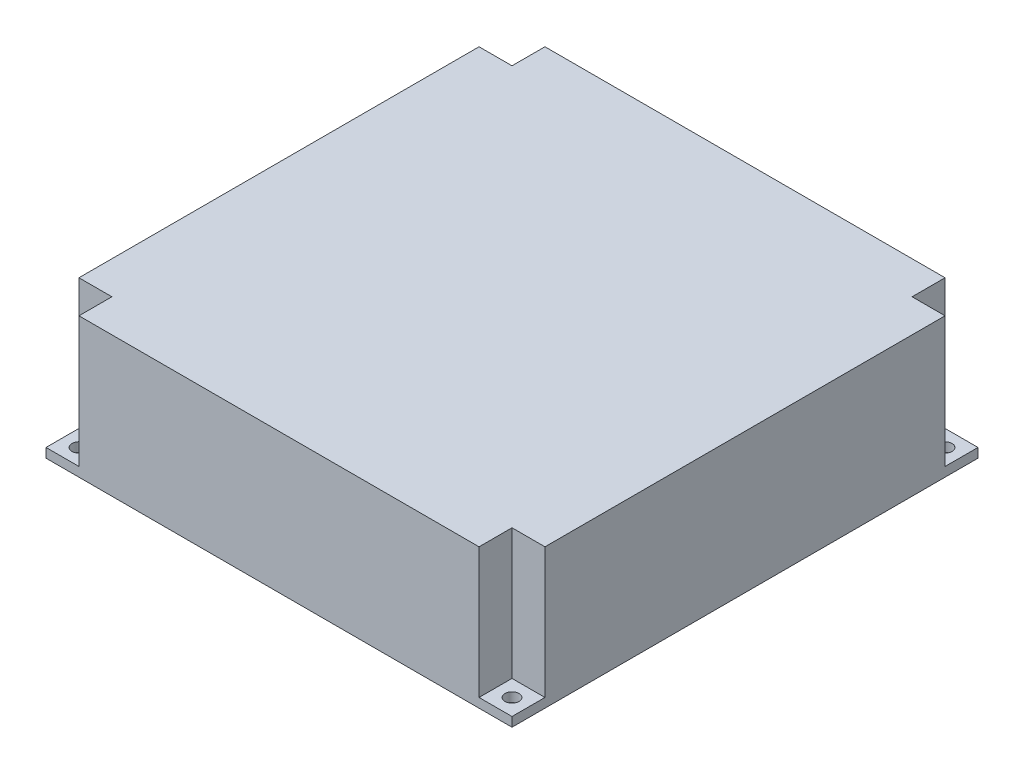
ISO-10303-21;
HEADER;
FILE_DESCRIPTION(('STEP AP214'),'2;1');
FILE_NAME('part.step','',(''),(''),'','','');
FILE_SCHEMA(('AUTOMOTIVE_DESIGN { 1 0 10303 214 1 1 1 1 }'));
ENDSEC;
DATA;
#1=APPLICATION_CONTEXT('core data for automotive mechanical design processes');
#2=APPLICATION_PROTOCOL_DEFINITION('international standard','automotive_design',2000,#1);
#3=PRODUCT_CONTEXT('',#1,'mechanical');
#4=PRODUCT('Part','Part','',(#3));
#5=PRODUCT_RELATED_PRODUCT_CATEGORY('part','',(#4));
#6=PRODUCT_DEFINITION_FORMATION('','',#4);
#7=PRODUCT_DEFINITION_CONTEXT('part definition',#1,'design');
#8=PRODUCT_DEFINITION('design','',#6,#7);
#9=PRODUCT_DEFINITION_SHAPE('','',#8);
#10=(LENGTH_UNIT() NAMED_UNIT(*) SI_UNIT(.MILLI.,.METRE.));
#11=(NAMED_UNIT(*) PLANE_ANGLE_UNIT() SI_UNIT($,.RADIAN.));
#12=(NAMED_UNIT(*) SI_UNIT($,.STERADIAN.) SOLID_ANGLE_UNIT());
#13=UNCERTAINTY_MEASURE_WITH_UNIT(LENGTH_MEASURE(1.E-05),#10,'distance_accuracy_value','');
#14=(GEOMETRIC_REPRESENTATION_CONTEXT(3) GLOBAL_UNCERTAINTY_ASSIGNED_CONTEXT((#13)) GLOBAL_UNIT_ASSIGNED_CONTEXT((#10,
#11,#12)) REPRESENTATION_CONTEXT('',''));
#15=CARTESIAN_POINT('',(0.,0.,0.));
#16=DIRECTION('',(0.,0.,1.));
#17=DIRECTION('',(1.,0.,0.));
#18=AXIS2_PLACEMENT_3D('',#15,#16,#17);
#19=CARTESIAN_POINT('',(-46.4644660940671,-8.,-46.4644660940674));
#20=DIRECTION('',(0.,1.,0.));
#21=DIRECTION('',(0.,0.,1.));
#22=AXIS2_PLACEMENT_3D('',#19,#20,#21);
#23=CYLINDRICAL_SURFACE('',#22,1.5);
#24=CARTESIAN_POINT('',(-46.4644660940671,0.,-46.4644660940674));
#25=DIRECTION('',(0.,1.,0.));
#26=DIRECTION('',(0.,0.,1.));
#27=AXIS2_PLACEMENT_3D('',#24,#25,#26);
#28=CIRCLE('',#27,1.5);
#29=CARTESIAN_POINT('',(-46.4644660940671,0.,-44.9644660940674));
#30=VERTEX_POINT('',#29);
#31=EDGE_CURVE('E387',#30,#30,#28,.T.);
#32=ORIENTED_EDGE('',*,*,#31,.F.);
#33=EDGE_LOOP('',(#32));
#34=FACE_BOUND('',#33,.T.);
#35=CARTESIAN_POINT('',(-46.4644660940671,2.,-46.4644660940674));
#36=DIRECTION('',(0.,1.,0.));
#37=DIRECTION('',(0.,0.,1.));
#38=AXIS2_PLACEMENT_3D('',#35,#36,#37);
#39=CIRCLE('',#38,1.5);
#40=CARTESIAN_POINT('',(-46.4644660940671,2.,-44.9644660940674));
#41=VERTEX_POINT('',#40);
#42=EDGE_CURVE('E399',#41,#41,#39,.F.);
#43=ORIENTED_EDGE('',*,*,#42,.F.);
#44=EDGE_LOOP('',(#43));
#45=FACE_BOUND('',#44,.T.);
#46=ADVANCED_FACE('F38',(#34,#45),#23,.F.);
#47=CARTESIAN_POINT('',(46.4644660940676,-8.,-46.464466094067));
#48=DIRECTION('',(0.,1.,0.));
#49=DIRECTION('',(0.,0.,1.));
#50=AXIS2_PLACEMENT_3D('',#47,#48,#49);
#51=CYLINDRICAL_SURFACE('',#50,1.50000000000001);
#52=CARTESIAN_POINT('',(46.4644660940676,0.,-46.464466094067));
#53=DIRECTION('',(0.,1.,0.));
#54=DIRECTION('',(0.,0.,1.));
#55=AXIS2_PLACEMENT_3D('',#52,#53,#54);
#56=CIRCLE('',#55,1.50000000000001);
#57=CARTESIAN_POINT('',(46.4644660940676,0.,-44.964466094067));
#58=VERTEX_POINT('',#57);
#59=EDGE_CURVE('E390',#58,#58,#56,.T.);
#60=ORIENTED_EDGE('',*,*,#59,.F.);
#61=EDGE_LOOP('',(#60));
#62=FACE_BOUND('',#61,.T.);
#63=CARTESIAN_POINT('',(46.4644660940676,2.,-46.464466094067));
#64=DIRECTION('',(0.,1.,0.));
#65=DIRECTION('',(0.,0.,1.));
#66=AXIS2_PLACEMENT_3D('',#63,#64,#65);
#67=CIRCLE('',#66,1.50000000000001);
#68=CARTESIAN_POINT('',(46.4644660940676,2.,-44.964466094067));
#69=VERTEX_POINT('',#68);
#70=EDGE_CURVE('E397',#69,#69,#67,.F.);
#71=ORIENTED_EDGE('',*,*,#70,.F.);
#72=EDGE_LOOP('',(#71));
#73=FACE_BOUND('',#72,.T.);
#74=ADVANCED_FACE('F427',(#62,#73),#51,.F.);
#75=CARTESIAN_POINT('',(46.4644660940668,-8.,46.4644660940678));
#76=DIRECTION('',(0.,1.,0.));
#77=DIRECTION('',(0.,0.,1.));
#78=AXIS2_PLACEMENT_3D('',#75,#76,#77);
#79=CYLINDRICAL_SURFACE('',#78,1.50000000000001);
#80=CARTESIAN_POINT('',(46.4644660940668,0.,46.4644660940678));
#81=DIRECTION('',(0.,1.,0.));
#82=DIRECTION('',(0.,0.,1.));
#83=AXIS2_PLACEMENT_3D('',#80,#81,#82);
#84=CIRCLE('',#83,1.50000000000001);
#85=CARTESIAN_POINT('',(46.4644660940668,0.,47.9644660940678));
#86=VERTEX_POINT('',#85);
#87=EDGE_CURVE('E372',#86,#86,#84,.T.);
#88=ORIENTED_EDGE('',*,*,#87,.F.);
#89=EDGE_LOOP('',(#88));
#90=FACE_BOUND('',#89,.T.);
#91=CARTESIAN_POINT('',(46.4644660940668,2.,46.4644660940678));
#92=DIRECTION('',(0.,1.,0.));
#93=DIRECTION('',(0.,0.,1.));
#94=AXIS2_PLACEMENT_3D('',#91,#92,#93);
#95=CIRCLE('',#94,1.50000000000001);
#96=CARTESIAN_POINT('',(46.4644660940668,2.,47.9644660940678));
#97=VERTEX_POINT('',#96);
#98=EDGE_CURVE('E350',#97,#97,#95,.F.);
#99=ORIENTED_EDGE('',*,*,#98,.F.);
#100=EDGE_LOOP('',(#99));
#101=FACE_BOUND('',#100,.T.);
#102=ADVANCED_FACE('F433',(#90,#101),#79,.F.);
#103=CARTESIAN_POINT('',(50.,30.,-50.));
#104=DIRECTION('',(-1.,0.,0.));
#105=DIRECTION('',(0.,0.,1.));
#106=AXIS2_PLACEMENT_3D('',#103,#104,#105);
#107=PLANE('',#106);
#108=DIRECTION('',(0.,0.,-1.));
#109=VECTOR('',#108,1.);
#110=CARTESIAN_POINT('',(50.,30.,-50.));
#111=LINE('',#110,#109);
#112=CARTESIAN_POINT('',(50.,30.,42.928932188135));
#113=VERTEX_POINT('',#112);
#114=CARTESIAN_POINT('',(50.0000000000003,30.,-42.9289321881342));
#115=VERTEX_POINT('',#114);
#116=EDGE_CURVE('E354',#113,#115,#111,.T.);
#117=ORIENTED_EDGE('',*,*,#116,.F.);
#118=DIRECTION('',(0.,1.,0.));
#119=VECTOR('',#118,1.);
#120=CARTESIAN_POINT('',(49.9999999999996,2.,42.928932188135));
#121=LINE('',#120,#119);
#122=CARTESIAN_POINT('',(49.9999999999996,2.,42.928932188135));
#123=VERTEX_POINT('',#122);
#124=EDGE_CURVE('E312',#123,#113,#121,.T.);
#125=ORIENTED_EDGE('',*,*,#124,.F.);
#126=DIRECTION('',(0.,0.,-1.));
#127=VECTOR('',#126,1.);
#128=CARTESIAN_POINT('',(49.9999999999996,2.,42.928932188135));
#129=LINE('',#128,#127);
#130=CARTESIAN_POINT('',(49.9999999999995,2.,50.0000000000005));
#131=VERTEX_POINT('',#130);
#132=EDGE_CURVE('E321',#131,#123,#129,.T.);
#133=ORIENTED_EDGE('',*,*,#132,.F.);
#134=DIRECTION('',(0.,-1.,0.));
#135=VECTOR('',#134,1.);
#136=CARTESIAN_POINT('',(50.,30.,50.));
#137=LINE('',#136,#135);
#138=CARTESIAN_POINT('',(50.,0.,50.));
#139=VERTEX_POINT('',#138);
#140=EDGE_CURVE('E367',#131,#139,#137,.T.);
#141=ORIENTED_EDGE('',*,*,#140,.T.);
#142=DIRECTION('',(0.,0.,-1.));
#143=VECTOR('',#142,1.);
#144=CARTESIAN_POINT('',(50.,0.,-50.));
#145=LINE('',#144,#143);
#146=CARTESIAN_POINT('',(50.,0.,-50.));
#147=VERTEX_POINT('',#146);
#148=EDGE_CURVE('E368',#139,#147,#145,.T.);
#149=ORIENTED_EDGE('',*,*,#148,.T.);
#150=DIRECTION('',(0.,-1.,0.));
#151=VECTOR('',#150,1.);
#152=CARTESIAN_POINT('',(50.,30.,-50.));
#153=LINE('',#152,#151);
#154=CARTESIAN_POINT('',(50.0000000000003,2.,-49.9999999999997));
#155=VERTEX_POINT('',#154);
#156=EDGE_CURVE('E11',#155,#147,#153,.T.);
#157=ORIENTED_EDGE('',*,*,#156,.F.);
#158=DIRECTION('',(0.,0.,-1.));
#159=VECTOR('',#158,1.);
#160=CARTESIAN_POINT('',(50.0000000000003,2.,-42.9289321881342));
#161=LINE('',#160,#159);
#162=CARTESIAN_POINT('',(50.0000000000003,2.,-42.9289321881342));
#163=VERTEX_POINT('',#162);
#164=EDGE_CURVE('E291',#163,#155,#161,.T.);
#165=ORIENTED_EDGE('',*,*,#164,.F.);
#166=DIRECTION('',(0.,1.,0.));
#167=VECTOR('',#166,1.);
#168=CARTESIAN_POINT('',(50.0000000000003,2.,-42.9289321881342));
#169=LINE('',#168,#167);
#170=EDGE_CURVE('E294',#163,#115,#169,.T.);
#171=ORIENTED_EDGE('',*,*,#170,.T.);
#172=EDGE_LOOP('',(#117,#125,#133,#141,#149,#157,#165,#171));
#173=FACE_BOUND('',#172,.T.);
#174=ADVANCED_FACE('F40',(#173),#107,.F.);
#175=CARTESIAN_POINT('',(-50.,30.,-50.));
#176=DIRECTION('',(0.,0.,1.));
#177=DIRECTION('',(1.,0.,0.));
#178=AXIS2_PLACEMENT_3D('',#175,#176,#177);
#179=PLANE('',#178);
#180=DIRECTION('',(-1.,0.,0.));
#181=VECTOR('',#180,1.);
#182=CARTESIAN_POINT('',(-50.,30.,-50.));
#183=LINE('',#182,#181);
#184=CARTESIAN_POINT('',(42.9289321881348,30.,-50.));
#185=VERTEX_POINT('',#184);
#186=CARTESIAN_POINT('',(-42.9289321881344,30.,-50.0000000000002));
#187=VERTEX_POINT('',#186);
#188=EDGE_CURVE('E357',#185,#187,#183,.T.);
#189=ORIENTED_EDGE('',*,*,#188,.F.);
#190=DIRECTION('',(0.,1.,0.));
#191=VECTOR('',#190,1.);
#192=CARTESIAN_POINT('',(42.9289321881349,2.,-49.9999999999997));
#193=LINE('',#192,#191);
#194=CARTESIAN_POINT('',(42.9289321881349,2.,-49.9999999999997));
#195=VERTEX_POINT('',#194);
#196=EDGE_CURVE('E289',#195,#185,#193,.T.);
#197=ORIENTED_EDGE('',*,*,#196,.F.);
#198=DIRECTION('',(-1.,0.,0.));
#199=VECTOR('',#198,1.);
#200=CARTESIAN_POINT('',(42.9289321881349,2.,-49.9999999999997));
#201=LINE('',#200,#199);
#202=EDGE_CURVE('E300',#155,#195,#201,.T.);
#203=ORIENTED_EDGE('',*,*,#202,.F.);
#204=ORIENTED_EDGE('',*,*,#156,.T.);
#205=DIRECTION('',(-1.,0.,0.));
#206=VECTOR('',#205,1.);
#207=CARTESIAN_POINT('',(-50.,0.,-50.));
#208=LINE('',#207,#206);
#209=CARTESIAN_POINT('',(-50.,0.,-50.));
#210=VERTEX_POINT('',#209);
#211=EDGE_CURVE('E371',#147,#210,#208,.T.);
#212=ORIENTED_EDGE('',*,*,#211,.T.);
#213=DIRECTION('',(0.,-1.,0.));
#214=VECTOR('',#213,1.);
#215=CARTESIAN_POINT('',(-50.,30.,-50.));
#216=LINE('',#215,#214);
#217=CARTESIAN_POINT('',(-49.9999999999998,2.,-50.0000000000002));
#218=VERTEX_POINT('',#217);
#219=EDGE_CURVE('E47',#218,#210,#216,.T.);
#220=ORIENTED_EDGE('',*,*,#219,.F.);
#221=DIRECTION('',(-1.,0.,0.));
#222=VECTOR('',#221,1.);
#223=CARTESIAN_POINT('',(-42.9289321881344,2.,-50.0000000000002));
#224=LINE('',#223,#222);
#225=CARTESIAN_POINT('',(-42.9289321881344,2.,-50.0000000000002));
#226=VERTEX_POINT('',#225);
#227=EDGE_CURVE('E266',#226,#218,#224,.T.);
#228=ORIENTED_EDGE('',*,*,#227,.F.);
#229=DIRECTION('',(0.,1.,0.));
#230=VECTOR('',#229,1.);
#231=CARTESIAN_POINT('',(-42.9289321881344,2.,-50.0000000000002));
#232=LINE('',#231,#230);
#233=EDGE_CURVE('E269',#226,#187,#232,.T.);
#234=ORIENTED_EDGE('',*,*,#233,.T.);
#235=EDGE_LOOP('',(#189,#197,#203,#204,#212,#220,#228,#234));
#236=FACE_BOUND('',#235,.T.);
#237=ADVANCED_FACE('F458',(#236),#179,.F.);
#238=CARTESIAN_POINT('',(-50.,30.,-50.));
#239=DIRECTION('',(1.,0.,0.));
#240=DIRECTION('',(0.,0.,-1.));
#241=AXIS2_PLACEMENT_3D('',#238,#239,#240);
#242=PLANE('',#241);
#243=DIRECTION('',(0.,0.,1.));
#244=VECTOR('',#243,1.);
#245=CARTESIAN_POINT('',(-50.,30.,-50.));
#246=LINE('',#245,#244);
#247=CARTESIAN_POINT('',(-50.,30.,-42.9289321881347));
#248=VERTEX_POINT('',#247);
#249=CARTESIAN_POINT('',(-50.,30.,42.9289321881345));
#250=VERTEX_POINT('',#249);
#251=EDGE_CURVE('E361',#248,#250,#246,.T.);
#252=ORIENTED_EDGE('',*,*,#251,.F.);
#253=DIRECTION('',(0.,1.,0.));
#254=VECTOR('',#253,1.);
#255=CARTESIAN_POINT('',(-49.9999999999999,2.,-42.9289321881347));
#256=LINE('',#255,#254);
#257=CARTESIAN_POINT('',(-49.9999999999999,2.,-42.9289321881347));
#258=VERTEX_POINT('',#257);
#259=EDGE_CURVE('E264',#258,#248,#256,.T.);
#260=ORIENTED_EDGE('',*,*,#259,.F.);
#261=DIRECTION('',(0.,0.,1.));
#262=VECTOR('',#261,1.);
#263=CARTESIAN_POINT('',(-49.9999999999999,2.,-42.9289321881347));
#264=LINE('',#263,#262);
#265=EDGE_CURVE('E276',#218,#258,#264,.T.);
#266=ORIENTED_EDGE('',*,*,#265,.F.);
#267=ORIENTED_EDGE('',*,*,#219,.T.);
#268=DIRECTION('',(0.,0.,1.));
#269=VECTOR('',#268,1.);
#270=CARTESIAN_POINT('',(-50.,0.,-50.));
#271=LINE('',#270,#269);
#272=CARTESIAN_POINT('',(-50.,0.,50.));
#273=VERTEX_POINT('',#272);
#274=EDGE_CURVE('E375',#210,#273,#271,.T.);
#275=ORIENTED_EDGE('',*,*,#274,.T.);
#276=DIRECTION('',(0.,-1.,0.));
#277=VECTOR('',#276,1.);
#278=CARTESIAN_POINT('',(-50.,30.,50.));
#279=LINE('',#278,#277);
#280=CARTESIAN_POINT('',(-50.,2.,50.));
#281=VERTEX_POINT('',#280);
#282=EDGE_CURVE('E381',#281,#273,#279,.T.);
#283=ORIENTED_EDGE('',*,*,#282,.F.);
#284=DIRECTION('',(0.,0.,1.));
#285=VECTOR('',#284,1.);
#286=CARTESIAN_POINT('',(-50.,2.,42.9289321881345));
#287=LINE('',#286,#285);
#288=CARTESIAN_POINT('',(-50.,2.,42.9289321881345));
#289=VERTEX_POINT('',#288);
#290=EDGE_CURVE('E333',#289,#281,#287,.T.);
#291=ORIENTED_EDGE('',*,*,#290,.F.);
#292=DIRECTION('',(0.,1.,0.));
#293=VECTOR('',#292,1.);
#294=CARTESIAN_POINT('',(-50.,2.,42.9289321881345));
#295=LINE('',#294,#293);
#296=EDGE_CURVE('E347',#289,#250,#295,.T.);
#297=ORIENTED_EDGE('',*,*,#296,.T.);
#298=EDGE_LOOP('',(#252,#260,#266,#267,#275,#283,#291,#297));
#299=FACE_BOUND('',#298,.T.);
#300=ADVANCED_FACE('F455',(#299),#242,.F.);
#301=CARTESIAN_POINT('',(-50.,30.,50.));
#302=DIRECTION('',(0.,0.,-1.));
#303=DIRECTION('',(-1.,0.,0.));
#304=AXIS2_PLACEMENT_3D('',#301,#302,#303);
#305=PLANE('',#304);
#306=DIRECTION('',(1.,0.,0.));
#307=VECTOR('',#306,1.);
#308=CARTESIAN_POINT('',(42.928932188134,2.,50.0000000000005));
#309=LINE('',#308,#307);
#310=CARTESIAN_POINT('',(42.928932188134,2.,50.0000000000005));
#311=VERTEX_POINT('',#310);
#312=EDGE_CURVE('E314',#311,#131,#309,.T.);
#313=ORIENTED_EDGE('',*,*,#312,.F.);
#314=DIRECTION('',(0.,1.,0.));
#315=VECTOR('',#314,1.);
#316=CARTESIAN_POINT('',(42.928932188134,2.,50.0000000000005));
#317=LINE('',#316,#315);
#318=CARTESIAN_POINT('',(42.928932188134,30.,50.0000000000005));
#319=VERTEX_POINT('',#318);
#320=EDGE_CURVE('E263',#311,#319,#317,.T.);
#321=ORIENTED_EDGE('',*,*,#320,.T.);
#322=DIRECTION('',(1.,0.,0.));
#323=VECTOR('',#322,1.);
#324=CARTESIAN_POINT('',(-50.,30.,50.));
#325=LINE('',#324,#323);
#326=CARTESIAN_POINT('',(-42.9289321881345,30.,50.));
#327=VERTEX_POINT('',#326);
#328=EDGE_CURVE('E364',#327,#319,#325,.T.);
#329=ORIENTED_EDGE('',*,*,#328,.F.);
#330=DIRECTION('',(0.,1.,0.));
#331=VECTOR('',#330,1.);
#332=CARTESIAN_POINT('',(-42.9289321881345,2.,50.));
#333=LINE('',#332,#331);
#334=CARTESIAN_POINT('',(-42.9289321881345,2.,50.));
#335=VERTEX_POINT('',#334);
#336=EDGE_CURVE('E63',#335,#327,#333,.T.);
#337=ORIENTED_EDGE('',*,*,#336,.F.);
#338=DIRECTION('',(1.,0.,0.));
#339=VECTOR('',#338,1.);
#340=CARTESIAN_POINT('',(-42.9289321881345,2.,50.));
#341=LINE('',#340,#339);
#342=EDGE_CURVE('E335',#281,#335,#341,.T.);
#343=ORIENTED_EDGE('',*,*,#342,.F.);
#344=ORIENTED_EDGE('',*,*,#282,.T.);
#345=DIRECTION('',(1.,0.,0.));
#346=VECTOR('',#345,1.);
#347=CARTESIAN_POINT('',(-50.,0.,50.));
#348=LINE('',#347,#346);
#349=EDGE_CURVE('E358',#273,#139,#348,.T.);
#350=ORIENTED_EDGE('',*,*,#349,.T.);
#351=ORIENTED_EDGE('',*,*,#140,.F.);
#352=EDGE_LOOP('',(#313,#321,#329,#337,#343,#344,#350,#351));
#353=FACE_BOUND('',#352,.T.);
#354=ADVANCED_FACE('F449',(#353),#305,.F.);
#355=CARTESIAN_POINT('',(0.,30.,0.));
#356=DIRECTION('',(0.,1.,0.));
#357=DIRECTION('',(0.,0.,1.));
#358=AXIS2_PLACEMENT_3D('',#355,#356,#357);
#359=PLANE('',#358);
#360=DIRECTION('',(0.,0.,1.));
#361=VECTOR('',#360,1.);
#362=CARTESIAN_POINT('',(42.9289321881341,30.,42.928932188135));
#363=LINE('',#362,#361);
#364=CARTESIAN_POINT('',(42.9289321881341,30.,42.928932188135));
#365=VERTEX_POINT('',#364);
#366=EDGE_CURVE('E319',#365,#319,#363,.T.);
#367=ORIENTED_EDGE('',*,*,#366,.F.);
#368=DIRECTION('',(-1.,0.,0.));
#369=VECTOR('',#368,1.);
#370=CARTESIAN_POINT('',(42.9289321881341,30.,42.928932188135));
#371=LINE('',#370,#369);
#372=EDGE_CURVE('E297',#113,#365,#371,.T.);
#373=ORIENTED_EDGE('',*,*,#372,.F.);
#374=ORIENTED_EDGE('',*,*,#116,.T.);
#375=DIRECTION('',(1.,0.,0.));
#376=VECTOR('',#375,1.);
#377=CARTESIAN_POINT('',(42.9289321881348,30.,-42.9289321881343));
#378=LINE('',#377,#376);
#379=CARTESIAN_POINT('',(42.9289321881348,30.,-42.9289321881343));
#380=VERTEX_POINT('',#379);
#381=EDGE_CURVE('E298',#380,#115,#378,.T.);
#382=ORIENTED_EDGE('',*,*,#381,.F.);
#383=DIRECTION('',(0.,0.,1.));
#384=VECTOR('',#383,1.);
#385=CARTESIAN_POINT('',(42.9289321881348,30.,-42.9289321881343));
#386=LINE('',#385,#384);
#387=EDGE_CURVE('E272',#185,#380,#386,.T.);
#388=ORIENTED_EDGE('',*,*,#387,.F.);
#389=ORIENTED_EDGE('',*,*,#188,.T.);
#390=DIRECTION('',(0.,0.,-1.));
#391=VECTOR('',#390,1.);
#392=CARTESIAN_POINT('',(-42.9289321881344,30.,-42.9289321881347));
#393=LINE('',#392,#391);
#394=CARTESIAN_POINT('',(-42.9289321881344,30.,-42.9289321881347));
#395=VERTEX_POINT('',#394);
#396=EDGE_CURVE('E273',#395,#187,#393,.T.);
#397=ORIENTED_EDGE('',*,*,#396,.F.);
#398=DIRECTION('',(1.,0.,0.));
#399=VECTOR('',#398,1.);
#400=CARTESIAN_POINT('',(-42.9289321881344,30.,-42.9289321881347));
#401=LINE('',#400,#399);
#402=EDGE_CURVE('E275',#248,#395,#401,.T.);
#403=ORIENTED_EDGE('',*,*,#402,.F.);
#404=ORIENTED_EDGE('',*,*,#251,.T.);
#405=DIRECTION('',(-1.,0.,0.));
#406=VECTOR('',#405,1.);
#407=CARTESIAN_POINT('',(-42.9289321881345,30.,42.9289321881345));
#408=LINE('',#407,#406);
#409=CARTESIAN_POINT('',(-42.9289321881345,30.,42.9289321881345));
#410=VERTEX_POINT('',#409);
#411=EDGE_CURVE('E336',#410,#250,#408,.T.);
#412=ORIENTED_EDGE('',*,*,#411,.F.);
#413=DIRECTION('',(0.,0.,-1.));
#414=VECTOR('',#413,1.);
#415=CARTESIAN_POINT('',(-42.9289321881345,30.,42.9289321881345));
#416=LINE('',#415,#414);
#417=EDGE_CURVE('E279',#327,#410,#416,.T.);
#418=ORIENTED_EDGE('',*,*,#417,.F.);
#419=ORIENTED_EDGE('',*,*,#328,.T.);
#420=EDGE_LOOP('',(#367,#373,#374,#382,#388,#389,#397,#403,#404,#412,#418,#419));
#421=FACE_BOUND('',#420,.T.);
#422=ADVANCED_FACE('F446',(#421),#359,.T.);
#423=CARTESIAN_POINT('',(0.,0.,0.));
#424=DIRECTION('',(0.,1.,0.));
#425=DIRECTION('',(0.,0.,1.));
#426=AXIS2_PLACEMENT_3D('',#423,#424,#425);
#427=PLANE('',#426);
#428=DIRECTION('',(0.,0.,1.));
#429=VECTOR('',#428,1.);
#430=CARTESIAN_POINT('',(40.9289321881345,0.,2.81147158996242E-13));
#431=LINE('',#430,#429);
#432=CARTESIAN_POINT('',(40.9289321881348,0.,-48.));
#433=VERTEX_POINT('',#432);
#434=CARTESIAN_POINT('',(40.9289321881348,0.,-40.9289321881343));
#435=VERTEX_POINT('',#434);
#436=EDGE_CURVE('E255',#433,#435,#431,.T.);
#437=ORIENTED_EDGE('',*,*,#436,.F.);
#438=DIRECTION('',(-1.,0.,0.));
#439=VECTOR('',#438,1.);
#440=CARTESIAN_POINT('',(-50.,0.,-48.));
#441=LINE('',#440,#439);
#442=CARTESIAN_POINT('',(-40.9289321881344,0.,-48.));
#443=VERTEX_POINT('',#442);
#444=EDGE_CURVE('E237',#433,#443,#441,.T.);
#445=ORIENTED_EDGE('',*,*,#444,.T.);
#446=DIRECTION('',(0.,0.,-1.));
#447=VECTOR('',#446,1.);
#448=CARTESIAN_POINT('',(-40.9289321881345,0.,-1.20491639569818E-13));
#449=LINE('',#448,#447);
#450=CARTESIAN_POINT('',(-40.9289321881344,0.,-40.9289321881347));
#451=VERTEX_POINT('',#450);
#452=EDGE_CURVE('E246',#451,#443,#449,.T.);
#453=ORIENTED_EDGE('',*,*,#452,.F.);
#454=DIRECTION('',(1.,0.,0.));
#455=VECTOR('',#454,1.);
#456=CARTESIAN_POINT('',(1.20491639569818E-13,0.,-40.9289321881346));
#457=LINE('',#456,#455);
#458=CARTESIAN_POINT('',(-48.,0.,-40.9289321881347));
#459=VERTEX_POINT('',#458);
#460=EDGE_CURVE('E241',#459,#451,#457,.T.);
#461=ORIENTED_EDGE('',*,*,#460,.F.);
#462=DIRECTION('',(0.,0.,1.));
#463=VECTOR('',#462,1.);
#464=CARTESIAN_POINT('',(-48.,0.,-50.));
#465=LINE('',#464,#463);
#466=CARTESIAN_POINT('',(-48.,0.,40.9289321881345));
#467=VERTEX_POINT('',#466);
#468=EDGE_CURVE('E225',#459,#467,#465,.T.);
#469=ORIENTED_EDGE('',*,*,#468,.T.);
#470=DIRECTION('',(-1.,0.,0.));
#471=VECTOR('',#470,1.);
#472=CARTESIAN_POINT('',(-42.9289321881345,0.,40.9289321881345));
#473=LINE('',#472,#471);
#474=CARTESIAN_POINT('',(-40.9289321881345,0.,40.9289321881345));
#475=VERTEX_POINT('',#474);
#476=EDGE_CURVE('E873',#475,#467,#473,.T.);
#477=ORIENTED_EDGE('',*,*,#476,.F.);
#478=DIRECTION('',(0.,0.,-1.));
#479=VECTOR('',#478,1.);
#480=CARTESIAN_POINT('',(-40.9289321881345,0.,42.9289321881345));
#481=LINE('',#480,#479);
#482=CARTESIAN_POINT('',(-40.9289321881345,0.,48.));
#483=VERTEX_POINT('',#482);
#484=EDGE_CURVE('E876',#483,#475,#481,.T.);
#485=ORIENTED_EDGE('',*,*,#484,.F.);
#486=DIRECTION('',(1.,0.,0.));
#487=VECTOR('',#486,1.);
#488=CARTESIAN_POINT('',(-50.,0.,48.));
#489=LINE('',#488,#487);
#490=CARTESIAN_POINT('',(40.928932188134,0.,48.));
#491=VERTEX_POINT('',#490);
#492=EDGE_CURVE('E236',#483,#491,#489,.T.);
#493=ORIENTED_EDGE('',*,*,#492,.T.);
#494=DIRECTION('',(0.,0.,1.));
#495=VECTOR('',#494,1.);
#496=CARTESIAN_POINT('',(40.9289321881345,0.,4.0163879856606E-13));
#497=LINE('',#496,#495);
#498=CARTESIAN_POINT('',(40.9289321881341,0.,40.928932188135));
#499=VERTEX_POINT('',#498);
#500=EDGE_CURVE('E900',#499,#491,#497,.T.);
#501=ORIENTED_EDGE('',*,*,#500,.F.);
#502=DIRECTION('',(-1.,0.,0.));
#503=VECTOR('',#502,1.);
#504=CARTESIAN_POINT('',(-4.0163879856606E-13,0.,40.9289321881346));
#505=LINE('',#504,#503);
#506=CARTESIAN_POINT('',(48.,0.,40.928932188135));
#507=VERTEX_POINT('',#506);
#508=EDGE_CURVE('E886',#507,#499,#505,.T.);
#509=ORIENTED_EDGE('',*,*,#508,.F.);
#510=DIRECTION('',(0.,0.,-1.));
#511=VECTOR('',#510,1.);
#512=CARTESIAN_POINT('',(48.,0.,-50.));
#513=LINE('',#512,#511);
#514=CARTESIAN_POINT('',(48.,0.,-40.9289321881342));
#515=VERTEX_POINT('',#514);
#516=EDGE_CURVE('E883',#507,#515,#513,.T.);
#517=ORIENTED_EDGE('',*,*,#516,.T.);
#518=DIRECTION('',(1.,0.,0.));
#519=VECTOR('',#518,1.);
#520=CARTESIAN_POINT('',(2.81147158996242E-13,0.,-40.9289321881345));
#521=LINE('',#520,#519);
#522=EDGE_CURVE('E252',#435,#515,#521,.T.);
#523=ORIENTED_EDGE('',*,*,#522,.F.);
#524=EDGE_LOOP('',(#437,#445,#453,#461,#469,#477,#485,#493,#501,#509,#517,#523));
#525=FACE_BOUND('',#524,.T.);
#526=ORIENTED_EDGE('',*,*,#87,.T.);
#527=EDGE_LOOP('',(#526));
#528=FACE_BOUND('',#527,.T.);
#529=ORIENTED_EDGE('',*,*,#59,.T.);
#530=EDGE_LOOP('',(#529));
#531=FACE_BOUND('',#530,.T.);
#532=ORIENTED_EDGE('',*,*,#31,.T.);
#533=EDGE_LOOP('',(#532));
#534=FACE_BOUND('',#533,.T.);
#535=CARTESIAN_POINT('',(-46.4644660940673,0.,46.4644660940673));
#536=DIRECTION('',(0.,1.,0.));
#537=DIRECTION('',(0.,0.,1.));
#538=AXIS2_PLACEMENT_3D('',#535,#536,#537);
#539=CIRCLE('',#538,1.5);
#540=CARTESIAN_POINT('',(-46.4644660940673,0.,47.9644660940673));
#541=VERTEX_POINT('',#540);
#542=EDGE_CURVE('E384',#541,#541,#539,.T.);
#543=ORIENTED_EDGE('',*,*,#542,.T.);
#544=EDGE_LOOP('',(#543));
#545=FACE_BOUND('',#544,.T.);
#546=ORIENTED_EDGE('',*,*,#148,.F.);
#547=ORIENTED_EDGE('',*,*,#349,.F.);
#548=ORIENTED_EDGE('',*,*,#274,.F.);
#549=ORIENTED_EDGE('',*,*,#211,.F.);
#550=EDGE_LOOP('',(#546,#547,#548,#549));
#551=FACE_BOUND('',#550,.T.);
#552=ADVANCED_FACE('F249',(#525,#528,#531,#534,#545,#551),#427,.F.);
#553=CARTESIAN_POINT('',(-46.4644660940673,-8.,46.4644660940673));
#554=DIRECTION('',(0.,1.,0.));
#555=DIRECTION('',(0.,0.,1.));
#556=AXIS2_PLACEMENT_3D('',#553,#554,#555);
#557=CYLINDRICAL_SURFACE('',#556,1.5);
#558=CARTESIAN_POINT('',(-46.4644660940673,2.,46.4644660940673));
#559=DIRECTION('',(0.,-1.,0.));
#560=DIRECTION('',(0.,0.,-1.));
#561=AXIS2_PLACEMENT_3D('',#558,#559,#560);
#562=CIRCLE('',#561,1.5);
#563=CARTESIAN_POINT('',(-46.4644660940673,2.,44.9644660940673));
#564=VERTEX_POINT('',#563);
#565=EDGE_CURVE('E42',#564,#564,#562,.F.);
#566=ORIENTED_EDGE('',*,*,#565,.T.);
#567=EDGE_LOOP('',(#566));
#568=FACE_BOUND('',#567,.T.);
#569=ORIENTED_EDGE('',*,*,#542,.F.);
#570=EDGE_LOOP('',(#569));
#571=FACE_BOUND('',#570,.T.);
#572=ADVANCED_FACE('F406',(#568,#571),#557,.F.);
#573=CARTESIAN_POINT('',(0.,2.,0.));
#574=DIRECTION('',(0.,1.,0.));
#575=DIRECTION('',(0.,0.,1.));
#576=AXIS2_PLACEMENT_3D('',#573,#574,#575);
#577=PLANE('',#576);
#578=ORIENTED_EDGE('',*,*,#132,.T.);
#579=DIRECTION('',(-1.,0.,0.));
#580=VECTOR('',#579,1.);
#581=CARTESIAN_POINT('',(42.9289321881341,2.,42.928932188135));
#582=LINE('',#581,#580);
#583=CARTESIAN_POINT('',(42.9289321881341,2.,42.928932188135));
#584=VERTEX_POINT('',#583);
#585=EDGE_CURVE('E328',#123,#584,#582,.T.);
#586=ORIENTED_EDGE('',*,*,#585,.T.);
#587=DIRECTION('',(0.,0.,1.));
#588=VECTOR('',#587,1.);
#589=CARTESIAN_POINT('',(42.9289321881341,2.,42.928932188135));
#590=LINE('',#589,#588);
#591=EDGE_CURVE('E325',#584,#311,#590,.T.);
#592=ORIENTED_EDGE('',*,*,#591,.T.);
#593=ORIENTED_EDGE('',*,*,#312,.T.);
#594=EDGE_LOOP('',(#578,#586,#592,#593));
#595=FACE_BOUND('',#594,.T.);
#596=ORIENTED_EDGE('',*,*,#98,.T.);
#597=EDGE_LOOP('',(#596));
#598=FACE_BOUND('',#597,.T.);
#599=ADVANCED_FACE('F445',(#595,#598),#577,.T.);
#600=CARTESIAN_POINT('',(42.9289321881341,2.,42.928932188135));
#601=DIRECTION('',(-1.,0.,0.));
#602=DIRECTION('',(0.,0.,1.));
#603=AXIS2_PLACEMENT_3D('',#600,#601,#602);
#604=PLANE('',#603);
#605=ORIENTED_EDGE('',*,*,#366,.T.);
#606=ORIENTED_EDGE('',*,*,#320,.F.);
#607=ORIENTED_EDGE('',*,*,#591,.F.);
#608=DIRECTION('',(0.,1.,0.));
#609=VECTOR('',#608,1.);
#610=CARTESIAN_POINT('',(42.9289321881341,2.,42.928932188135));
#611=LINE('',#610,#609);
#612=EDGE_CURVE('E315',#584,#365,#611,.T.);
#613=ORIENTED_EDGE('',*,*,#612,.T.);
#614=EDGE_LOOP('',(#605,#606,#607,#613));
#615=FACE_BOUND('',#614,.T.);
#616=ADVANCED_FACE('F508',(#615),#604,.F.);
#617=CARTESIAN_POINT('',(42.9289321881341,2.,42.928932188135));
#618=DIRECTION('',(0.,0.,-1.));
#619=DIRECTION('',(-1.,0.,0.));
#620=AXIS2_PLACEMENT_3D('',#617,#618,#619);
#621=PLANE('',#620);
#622=ORIENTED_EDGE('',*,*,#372,.T.);
#623=ORIENTED_EDGE('',*,*,#612,.F.);
#624=ORIENTED_EDGE('',*,*,#585,.F.);
#625=ORIENTED_EDGE('',*,*,#124,.T.);
#626=EDGE_LOOP('',(#622,#623,#624,#625));
#627=FACE_BOUND('',#626,.T.);
#628=ADVANCED_FACE('F513',(#627),#621,.F.);
#629=CARTESIAN_POINT('',(0.,2.,0.));
#630=DIRECTION('',(0.,1.,0.));
#631=DIRECTION('',(0.,0.,1.));
#632=AXIS2_PLACEMENT_3D('',#629,#630,#631);
#633=PLANE('',#632);
#634=ORIENTED_EDGE('',*,*,#202,.T.);
#635=DIRECTION('',(0.,0.,1.));
#636=VECTOR('',#635,1.);
#637=CARTESIAN_POINT('',(42.9289321881348,2.,-42.9289321881343));
#638=LINE('',#637,#636);
#639=CARTESIAN_POINT('',(42.9289321881348,2.,-42.9289321881343));
#640=VERTEX_POINT('',#639);
#641=EDGE_CURVE('E307',#195,#640,#638,.T.);
#642=ORIENTED_EDGE('',*,*,#641,.T.);
#643=DIRECTION('',(1.,0.,0.));
#644=VECTOR('',#643,1.);
#645=CARTESIAN_POINT('',(42.9289321881348,2.,-42.9289321881343));
#646=LINE('',#645,#644);
#647=EDGE_CURVE('E304',#640,#163,#646,.T.);
#648=ORIENTED_EDGE('',*,*,#647,.T.);
#649=ORIENTED_EDGE('',*,*,#164,.T.);
#650=EDGE_LOOP('',(#634,#642,#648,#649));
#651=FACE_BOUND('',#650,.T.);
#652=ORIENTED_EDGE('',*,*,#70,.T.);
#653=EDGE_LOOP('',(#652));
#654=FACE_BOUND('',#653,.T.);
#655=ADVANCED_FACE('F479',(#651,#654),#633,.T.);
#656=CARTESIAN_POINT('',(42.9289321881348,2.,-42.9289321881343));
#657=DIRECTION('',(0.,0.,1.));
#658=DIRECTION('',(1.,0.,0.));
#659=AXIS2_PLACEMENT_3D('',#656,#657,#658);
#660=PLANE('',#659);
#661=ORIENTED_EDGE('',*,*,#381,.T.);
#662=ORIENTED_EDGE('',*,*,#170,.F.);
#663=ORIENTED_EDGE('',*,*,#647,.F.);
#664=DIRECTION('',(0.,1.,0.));
#665=VECTOR('',#664,1.);
#666=CARTESIAN_POINT('',(42.9289321881348,2.,-42.9289321881343));
#667=LINE('',#666,#665);
#668=EDGE_CURVE('E292',#640,#380,#667,.T.);
#669=ORIENTED_EDGE('',*,*,#668,.T.);
#670=EDGE_LOOP('',(#661,#662,#663,#669));
#671=FACE_BOUND('',#670,.T.);
#672=ADVANCED_FACE('F516',(#671),#660,.F.);
#673=CARTESIAN_POINT('',(42.9289321881348,2.,-42.9289321881343));
#674=DIRECTION('',(-1.,0.,0.));
#675=DIRECTION('',(0.,0.,1.));
#676=AXIS2_PLACEMENT_3D('',#673,#674,#675);
#677=PLANE('',#676);
#678=ORIENTED_EDGE('',*,*,#387,.T.);
#679=ORIENTED_EDGE('',*,*,#668,.F.);
#680=ORIENTED_EDGE('',*,*,#641,.F.);
#681=ORIENTED_EDGE('',*,*,#196,.T.);
#682=EDGE_LOOP('',(#678,#679,#680,#681));
#683=FACE_BOUND('',#682,.T.);
#684=ADVANCED_FACE('F476',(#683),#677,.F.);
#685=CARTESIAN_POINT('',(0.,2.,0.));
#686=DIRECTION('',(0.,1.,0.));
#687=DIRECTION('',(0.,0.,1.));
#688=AXIS2_PLACEMENT_3D('',#685,#686,#687);
#689=PLANE('',#688);
#690=ORIENTED_EDGE('',*,*,#265,.T.);
#691=DIRECTION('',(1.,0.,0.));
#692=VECTOR('',#691,1.);
#693=CARTESIAN_POINT('',(-42.9289321881344,2.,-42.9289321881347));
#694=LINE('',#693,#692);
#695=CARTESIAN_POINT('',(-42.9289321881344,2.,-42.9289321881347));
#696=VERTEX_POINT('',#695);
#697=EDGE_CURVE('E284',#258,#696,#694,.T.);
#698=ORIENTED_EDGE('',*,*,#697,.T.);
#699=DIRECTION('',(0.,0.,-1.));
#700=VECTOR('',#699,1.);
#701=CARTESIAN_POINT('',(-42.9289321881344,2.,-42.9289321881347));
#702=LINE('',#701,#700);
#703=EDGE_CURVE('E281',#696,#226,#702,.T.);
#704=ORIENTED_EDGE('',*,*,#703,.T.);
#705=ORIENTED_EDGE('',*,*,#227,.T.);
#706=EDGE_LOOP('',(#690,#698,#704,#705));
#707=FACE_BOUND('',#706,.T.);
#708=ORIENTED_EDGE('',*,*,#42,.T.);
#709=EDGE_LOOP('',(#708));
#710=FACE_BOUND('',#709,.T.);
#711=ADVANCED_FACE('F497',(#707,#710),#689,.T.);
#712=CARTESIAN_POINT('',(-42.9289321881344,2.,-42.9289321881347));
#713=DIRECTION('',(1.,0.,0.));
#714=DIRECTION('',(0.,0.,-1.));
#715=AXIS2_PLACEMENT_3D('',#712,#713,#714);
#716=PLANE('',#715);
#717=ORIENTED_EDGE('',*,*,#396,.T.);
#718=ORIENTED_EDGE('',*,*,#233,.F.);
#719=ORIENTED_EDGE('',*,*,#703,.F.);
#720=DIRECTION('',(0.,1.,0.));
#721=VECTOR('',#720,1.);
#722=CARTESIAN_POINT('',(-42.9289321881344,2.,-42.9289321881347));
#723=LINE('',#722,#721);
#724=EDGE_CURVE('E267',#696,#395,#723,.T.);
#725=ORIENTED_EDGE('',*,*,#724,.T.);
#726=EDGE_LOOP('',(#717,#718,#719,#725));
#727=FACE_BOUND('',#726,.T.);
#728=ADVANCED_FACE('F422',(#727),#716,.F.);
#729=CARTESIAN_POINT('',(-42.9289321881344,2.,-42.9289321881347));
#730=DIRECTION('',(0.,0.,1.));
#731=DIRECTION('',(1.,0.,0.));
#732=AXIS2_PLACEMENT_3D('',#729,#730,#731);
#733=PLANE('',#732);
#734=ORIENTED_EDGE('',*,*,#402,.T.);
#735=ORIENTED_EDGE('',*,*,#724,.F.);
#736=ORIENTED_EDGE('',*,*,#697,.F.);
#737=ORIENTED_EDGE('',*,*,#259,.T.);
#738=EDGE_LOOP('',(#734,#735,#736,#737));
#739=FACE_BOUND('',#738,.T.);
#740=ADVANCED_FACE('F412',(#739),#733,.F.);
#741=CARTESIAN_POINT('',(0.,2.,0.));
#742=DIRECTION('',(0.,-1.,0.));
#743=DIRECTION('',(0.,0.,-1.));
#744=AXIS2_PLACEMENT_3D('',#741,#742,#743);
#745=PLANE('',#744);
#746=ORIENTED_EDGE('',*,*,#290,.T.);
#747=ORIENTED_EDGE('',*,*,#342,.T.);
#748=DIRECTION('',(0.,0.,-1.));
#749=VECTOR('',#748,1.);
#750=CARTESIAN_POINT('',(-42.9289321881345,2.,42.9289321881345));
#751=LINE('',#750,#749);
#752=CARTESIAN_POINT('',(-42.9289321881345,2.,42.9289321881345));
#753=VERTEX_POINT('',#752);
#754=EDGE_CURVE('E339',#335,#753,#751,.T.);
#755=ORIENTED_EDGE('',*,*,#754,.T.);
#756=DIRECTION('',(-1.,0.,0.));
#757=VECTOR('',#756,1.);
#758=CARTESIAN_POINT('',(-42.9289321881345,2.,42.9289321881345));
#759=LINE('',#758,#757);
#760=EDGE_CURVE('E342',#753,#289,#759,.T.);
#761=ORIENTED_EDGE('',*,*,#760,.T.);
#762=EDGE_LOOP('',(#746,#747,#755,#761));
#763=FACE_BOUND('',#762,.T.);
#764=ORIENTED_EDGE('',*,*,#565,.F.);
#765=EDGE_LOOP('',(#764));
#766=FACE_BOUND('',#765,.T.);
#767=ADVANCED_FACE('F409',(#763,#766),#745,.F.);
#768=CARTESIAN_POINT('',(-42.9289321881345,2.,42.9289321881345));
#769=DIRECTION('',(0.,0.,-1.));
#770=DIRECTION('',(-1.,0.,0.));
#771=AXIS2_PLACEMENT_3D('',#768,#769,#770);
#772=PLANE('',#771);
#773=ORIENTED_EDGE('',*,*,#411,.T.);
#774=ORIENTED_EDGE('',*,*,#296,.F.);
#775=ORIENTED_EDGE('',*,*,#760,.F.);
#776=DIRECTION('',(0.,1.,0.));
#777=VECTOR('',#776,1.);
#778=CARTESIAN_POINT('',(-42.9289321881345,2.,42.9289321881345));
#779=LINE('',#778,#777);
#780=EDGE_CURVE('E351',#753,#410,#779,.T.);
#781=ORIENTED_EDGE('',*,*,#780,.T.);
#782=EDGE_LOOP('',(#773,#774,#775,#781));
#783=FACE_BOUND('',#782,.T.);
#784=ADVANCED_FACE('F411',(#783),#772,.F.);
#785=CARTESIAN_POINT('',(-42.9289321881345,2.,42.9289321881345));
#786=DIRECTION('',(1.,0.,0.));
#787=DIRECTION('',(0.,0.,-1.));
#788=AXIS2_PLACEMENT_3D('',#785,#786,#787);
#789=PLANE('',#788);
#790=ORIENTED_EDGE('',*,*,#417,.T.);
#791=ORIENTED_EDGE('',*,*,#780,.F.);
#792=ORIENTED_EDGE('',*,*,#754,.F.);
#793=ORIENTED_EDGE('',*,*,#336,.T.);
#794=EDGE_LOOP('',(#790,#791,#792,#793));
#795=FACE_BOUND('',#794,.T.);
#796=ADVANCED_FACE('F419',(#795),#789,.F.);
#797=CARTESIAN_POINT('',(48.,30.,-50.));
#798=DIRECTION('',(-1.,0.,0.));
#799=DIRECTION('',(0.,0.,1.));
#800=AXIS2_PLACEMENT_3D('',#797,#798,#799);
#801=PLANE('',#800);
#802=DIRECTION('',(0.,0.,-1.));
#803=VECTOR('',#802,1.);
#804=CARTESIAN_POINT('',(48.,28.,-50.));
#805=LINE('',#804,#803);
#806=CARTESIAN_POINT('',(48.,28.,40.928932188135));
#807=VERTEX_POINT('',#806);
#808=CARTESIAN_POINT('',(48.,28.,-40.9289321881342));
#809=VERTEX_POINT('',#808);
#810=EDGE_CURVE('E912',#807,#809,#805,.T.);
#811=ORIENTED_EDGE('',*,*,#810,.T.);
#812=DIRECTION('',(0.,1.,0.));
#813=VECTOR('',#812,1.);
#814=CARTESIAN_POINT('',(48.,30.,-40.9289321881342));
#815=LINE('',#814,#813);
#816=EDGE_CURVE('E888',#515,#809,#815,.T.);
#817=ORIENTED_EDGE('',*,*,#816,.F.);
#818=ORIENTED_EDGE('',*,*,#516,.F.);
#819=DIRECTION('',(0.,1.,0.));
#820=VECTOR('',#819,1.);
#821=CARTESIAN_POINT('',(48.,2.,40.928932188135));
#822=LINE('',#821,#820);
#823=EDGE_CURVE('E902',#507,#807,#822,.T.);
#824=ORIENTED_EDGE('',*,*,#823,.T.);
#825=EDGE_LOOP('',(#811,#817,#818,#824));
#826=FACE_BOUND('',#825,.T.);
#827=ADVANCED_FACE('F605',(#826),#801,.T.);
#828=CARTESIAN_POINT('',(-50.,30.,-48.));
#829=DIRECTION('',(0.,0.,1.));
#830=DIRECTION('',(1.,0.,0.));
#831=AXIS2_PLACEMENT_3D('',#828,#829,#830);
#832=PLANE('',#831);
#833=DIRECTION('',(-1.,0.,0.));
#834=VECTOR('',#833,1.);
#835=CARTESIAN_POINT('',(-50.,28.,-48.));
#836=LINE('',#835,#834);
#837=CARTESIAN_POINT('',(40.9289321881348,28.,-48.));
#838=VERTEX_POINT('',#837);
#839=CARTESIAN_POINT('',(-40.9289321881344,28.,-48.));
#840=VERTEX_POINT('',#839);
#841=EDGE_CURVE('E880',#838,#840,#836,.T.);
#842=ORIENTED_EDGE('',*,*,#841,.T.);
#843=DIRECTION('',(0.,1.,0.));
#844=VECTOR('',#843,1.);
#845=CARTESIAN_POINT('',(-40.9289321881344,30.,-48.));
#846=LINE('',#845,#844);
#847=EDGE_CURVE('E895',#443,#840,#846,.T.);
#848=ORIENTED_EDGE('',*,*,#847,.F.);
#849=ORIENTED_EDGE('',*,*,#444,.F.);
#850=DIRECTION('',(0.,1.,0.));
#851=VECTOR('',#850,1.);
#852=CARTESIAN_POINT('',(40.9289321881348,2.,-48.));
#853=LINE('',#852,#851);
#854=EDGE_CURVE('E892',#433,#838,#853,.T.);
#855=ORIENTED_EDGE('',*,*,#854,.T.);
#856=EDGE_LOOP('',(#842,#848,#849,#855));
#857=FACE_BOUND('',#856,.T.);
#858=ADVANCED_FACE('F623',(#857),#832,.T.);
#859=CARTESIAN_POINT('',(-48.,30.,-50.));
#860=DIRECTION('',(1.,0.,0.));
#861=DIRECTION('',(0.,0.,-1.));
#862=AXIS2_PLACEMENT_3D('',#859,#860,#861);
#863=PLANE('',#862);
#864=DIRECTION('',(0.,0.,1.));
#865=VECTOR('',#864,1.);
#866=CARTESIAN_POINT('',(-48.,28.,-50.));
#867=LINE('',#866,#865);
#868=CARTESIAN_POINT('',(-48.,28.,-40.9289321881347));
#869=VERTEX_POINT('',#868);
#870=CARTESIAN_POINT('',(-48.,28.,40.9289321881345));
#871=VERTEX_POINT('',#870);
#872=EDGE_CURVE('E258',#869,#871,#867,.T.);
#873=ORIENTED_EDGE('',*,*,#872,.T.);
#874=DIRECTION('',(0.,1.,0.));
#875=VECTOR('',#874,1.);
#876=CARTESIAN_POINT('',(-48.,30.,40.9289321881345));
#877=LINE('',#876,#875);
#878=EDGE_CURVE('E232',#467,#871,#877,.T.);
#879=ORIENTED_EDGE('',*,*,#878,.F.);
#880=ORIENTED_EDGE('',*,*,#468,.F.);
#881=DIRECTION('',(0.,1.,0.));
#882=VECTOR('',#881,1.);
#883=CARTESIAN_POINT('',(-48.,2.,-40.9289321881347));
#884=LINE('',#883,#882);
#885=EDGE_CURVE('E229',#459,#869,#884,.T.);
#886=ORIENTED_EDGE('',*,*,#885,.T.);
#887=EDGE_LOOP('',(#873,#879,#880,#886));
#888=FACE_BOUND('',#887,.T.);
#889=ADVANCED_FACE('F228',(#888),#863,.T.);
#890=CARTESIAN_POINT('',(-50.,30.,48.));
#891=DIRECTION('',(0.,0.,-1.));
#892=DIRECTION('',(-1.,0.,0.));
#893=AXIS2_PLACEMENT_3D('',#890,#891,#892);
#894=PLANE('',#893);
#895=ORIENTED_EDGE('',*,*,#492,.F.);
#896=DIRECTION('',(0.,1.,0.));
#897=VECTOR('',#896,1.);
#898=CARTESIAN_POINT('',(-40.9289321881345,2.,48.));
#899=LINE('',#898,#897);
#900=CARTESIAN_POINT('',(-40.9289321881345,28.,48.));
#901=VERTEX_POINT('',#900);
#902=EDGE_CURVE('E859',#483,#901,#899,.T.);
#903=ORIENTED_EDGE('',*,*,#902,.T.);
#904=DIRECTION('',(1.,0.,0.));
#905=VECTOR('',#904,1.);
#906=CARTESIAN_POINT('',(-50.,28.,48.));
#907=LINE('',#906,#905);
#908=CARTESIAN_POINT('',(40.928932188134,28.,48.));
#909=VERTEX_POINT('',#908);
#910=EDGE_CURVE('E253',#901,#909,#907,.T.);
#911=ORIENTED_EDGE('',*,*,#910,.T.);
#912=DIRECTION('',(0.,1.,0.));
#913=VECTOR('',#912,1.);
#914=CARTESIAN_POINT('',(40.928932188134,30.,48.));
#915=LINE('',#914,#913);
#916=EDGE_CURVE('E871',#491,#909,#915,.T.);
#917=ORIENTED_EDGE('',*,*,#916,.F.);
#918=EDGE_LOOP('',(#895,#903,#911,#917));
#919=FACE_BOUND('',#918,.T.);
#920=ADVANCED_FACE('F644',(#919),#894,.T.);
#921=CARTESIAN_POINT('',(0.,28.,0.));
#922=DIRECTION('',(0.,1.,0.));
#923=DIRECTION('',(0.,0.,1.));
#924=AXIS2_PLACEMENT_3D('',#921,#922,#923);
#925=PLANE('',#924);
#926=DIRECTION('',(0.,0.,1.));
#927=VECTOR('',#926,1.);
#928=CARTESIAN_POINT('',(40.9289321881345,28.,4.0163879856606E-13));
#929=LINE('',#928,#927);
#930=CARTESIAN_POINT('',(40.9289321881341,28.,40.928932188135));
#931=VERTEX_POINT('',#930);
#932=EDGE_CURVE('E868',#931,#909,#929,.T.);
#933=ORIENTED_EDGE('',*,*,#932,.T.);
#934=ORIENTED_EDGE('',*,*,#910,.F.);
#935=DIRECTION('',(0.,0.,-1.));
#936=VECTOR('',#935,1.);
#937=CARTESIAN_POINT('',(-40.9289321881345,28.,0.));
#938=LINE('',#937,#936);
#939=CARTESIAN_POINT('',(-40.9289321881345,28.,40.9289321881345));
#940=VERTEX_POINT('',#939);
#941=EDGE_CURVE('E857',#901,#940,#938,.T.);
#942=ORIENTED_EDGE('',*,*,#941,.T.);
#943=DIRECTION('',(-1.,0.,0.));
#944=VECTOR('',#943,1.);
#945=CARTESIAN_POINT('',(0.,28.,40.9289321881345));
#946=LINE('',#945,#944);
#947=EDGE_CURVE('E864',#940,#871,#946,.T.);
#948=ORIENTED_EDGE('',*,*,#947,.T.);
#949=ORIENTED_EDGE('',*,*,#872,.F.);
#950=DIRECTION('',(1.,0.,0.));
#951=VECTOR('',#950,1.);
#952=CARTESIAN_POINT('',(1.20491639569818E-13,28.,-40.9289321881346));
#953=LINE('',#952,#951);
#954=CARTESIAN_POINT('',(-40.9289321881344,28.,-40.9289321881347));
#955=VERTEX_POINT('',#954);
#956=EDGE_CURVE('E244',#869,#955,#953,.T.);
#957=ORIENTED_EDGE('',*,*,#956,.T.);
#958=DIRECTION('',(0.,0.,-1.));
#959=VECTOR('',#958,1.);
#960=CARTESIAN_POINT('',(-40.9289321881345,28.,-1.20491639569818E-13));
#961=LINE('',#960,#959);
#962=EDGE_CURVE('E896',#955,#840,#961,.T.);
#963=ORIENTED_EDGE('',*,*,#962,.T.);
#964=ORIENTED_EDGE('',*,*,#841,.F.);
#965=DIRECTION('',(0.,0.,1.));
#966=VECTOR('',#965,1.);
#967=CARTESIAN_POINT('',(40.9289321881345,28.,2.81147158996242E-13));
#968=LINE('',#967,#966);
#969=CARTESIAN_POINT('',(40.9289321881348,28.,-40.9289321881343));
#970=VERTEX_POINT('',#969);
#971=EDGE_CURVE('E891',#838,#970,#968,.T.);
#972=ORIENTED_EDGE('',*,*,#971,.T.);
#973=DIRECTION('',(1.,0.,0.));
#974=VECTOR('',#973,1.);
#975=CARTESIAN_POINT('',(2.81147158996242E-13,28.,-40.9289321881345));
#976=LINE('',#975,#974);
#977=EDGE_CURVE('E889',#970,#809,#976,.T.);
#978=ORIENTED_EDGE('',*,*,#977,.T.);
#979=ORIENTED_EDGE('',*,*,#810,.F.);
#980=DIRECTION('',(-1.,0.,0.));
#981=VECTOR('',#980,1.);
#982=CARTESIAN_POINT('',(-4.0163879856606E-13,28.,40.9289321881346));
#983=LINE('',#982,#981);
#984=EDGE_CURVE('E885',#807,#931,#983,.T.);
#985=ORIENTED_EDGE('',*,*,#984,.T.);
#986=EDGE_LOOP('',(#933,#934,#942,#948,#949,#957,#963,#964,#972,#978,#979,#985));
#987=FACE_BOUND('',#986,.T.);
#988=ADVANCED_FACE('F654',(#987),#925,.F.);
#989=CARTESIAN_POINT('',(40.9289321881341,2.,42.928932188135));
#990=DIRECTION('',(-1.,0.,0.));
#991=DIRECTION('',(0.,0.,1.));
#992=AXIS2_PLACEMENT_3D('',#989,#990,#991);
#993=PLANE('',#992);
#994=ORIENTED_EDGE('',*,*,#932,.F.);
#995=DIRECTION('',(0.,1.,0.));
#996=VECTOR('',#995,1.);
#997=CARTESIAN_POINT('',(40.9289321881341,2.,40.928932188135));
#998=LINE('',#997,#996);
#999=EDGE_CURVE('E903',#499,#931,#998,.T.);
#1000=ORIENTED_EDGE('',*,*,#999,.F.);
#1001=ORIENTED_EDGE('',*,*,#500,.T.);
#1002=ORIENTED_EDGE('',*,*,#916,.T.);
#1003=EDGE_LOOP('',(#994,#1000,#1001,#1002));
#1004=FACE_BOUND('',#1003,.T.);
#1005=ADVANCED_FACE('F665',(#1004),#993,.T.);
#1006=CARTESIAN_POINT('',(42.9289321881341,2.,40.928932188135));
#1007=DIRECTION('',(0.,0.,-1.));
#1008=DIRECTION('',(-1.,0.,0.));
#1009=AXIS2_PLACEMENT_3D('',#1006,#1007,#1008);
#1010=PLANE('',#1009);
#1011=ORIENTED_EDGE('',*,*,#984,.F.);
#1012=ORIENTED_EDGE('',*,*,#823,.F.);
#1013=ORIENTED_EDGE('',*,*,#508,.T.);
#1014=ORIENTED_EDGE('',*,*,#999,.T.);
#1015=EDGE_LOOP('',(#1011,#1012,#1013,#1014));
#1016=FACE_BOUND('',#1015,.T.);
#1017=ADVANCED_FACE('F676',(#1016),#1010,.T.);
#1018=CARTESIAN_POINT('',(42.9289321881348,2.,-40.9289321881343));
#1019=DIRECTION('',(0.,0.,1.));
#1020=DIRECTION('',(1.,0.,0.));
#1021=AXIS2_PLACEMENT_3D('',#1018,#1019,#1020);
#1022=PLANE('',#1021);
#1023=ORIENTED_EDGE('',*,*,#977,.F.);
#1024=DIRECTION('',(0.,1.,0.));
#1025=VECTOR('',#1024,1.);
#1026=CARTESIAN_POINT('',(40.9289321881348,2.,-40.9289321881343));
#1027=LINE('',#1026,#1025);
#1028=EDGE_CURVE('E906',#435,#970,#1027,.T.);
#1029=ORIENTED_EDGE('',*,*,#1028,.F.);
#1030=ORIENTED_EDGE('',*,*,#522,.T.);
#1031=ORIENTED_EDGE('',*,*,#816,.T.);
#1032=EDGE_LOOP('',(#1023,#1029,#1030,#1031));
#1033=FACE_BOUND('',#1032,.T.);
#1034=ADVANCED_FACE('F687',(#1033),#1022,.T.);
#1035=CARTESIAN_POINT('',(40.9289321881348,2.,-42.9289321881343));
#1036=DIRECTION('',(-1.,0.,0.));
#1037=DIRECTION('',(0.,0.,1.));
#1038=AXIS2_PLACEMENT_3D('',#1035,#1036,#1037);
#1039=PLANE('',#1038);
#1040=ORIENTED_EDGE('',*,*,#971,.F.);
#1041=ORIENTED_EDGE('',*,*,#854,.F.);
#1042=ORIENTED_EDGE('',*,*,#436,.T.);
#1043=ORIENTED_EDGE('',*,*,#1028,.T.);
#1044=EDGE_LOOP('',(#1040,#1041,#1042,#1043));
#1045=FACE_BOUND('',#1044,.T.);
#1046=ADVANCED_FACE('F698',(#1045),#1039,.T.);
#1047=CARTESIAN_POINT('',(-40.9289321881344,2.,-42.9289321881347));
#1048=DIRECTION('',(1.,0.,0.));
#1049=DIRECTION('',(0.,0.,-1.));
#1050=AXIS2_PLACEMENT_3D('',#1047,#1048,#1049);
#1051=PLANE('',#1050);
#1052=ORIENTED_EDGE('',*,*,#962,.F.);
#1053=DIRECTION('',(0.,1.,0.));
#1054=VECTOR('',#1053,1.);
#1055=CARTESIAN_POINT('',(-40.9289321881344,2.,-40.9289321881347));
#1056=LINE('',#1055,#1054);
#1057=EDGE_CURVE('E55',#451,#955,#1056,.T.);
#1058=ORIENTED_EDGE('',*,*,#1057,.F.);
#1059=ORIENTED_EDGE('',*,*,#452,.T.);
#1060=ORIENTED_EDGE('',*,*,#847,.T.);
#1061=EDGE_LOOP('',(#1052,#1058,#1059,#1060));
#1062=FACE_BOUND('',#1061,.T.);
#1063=ADVANCED_FACE('F709',(#1062),#1051,.T.);
#1064=CARTESIAN_POINT('',(-42.9289321881344,2.,-40.9289321881347));
#1065=DIRECTION('',(0.,0.,1.));
#1066=DIRECTION('',(1.,0.,0.));
#1067=AXIS2_PLACEMENT_3D('',#1064,#1065,#1066);
#1068=PLANE('',#1067);
#1069=ORIENTED_EDGE('',*,*,#956,.F.);
#1070=ORIENTED_EDGE('',*,*,#885,.F.);
#1071=ORIENTED_EDGE('',*,*,#460,.T.);
#1072=ORIENTED_EDGE('',*,*,#1057,.T.);
#1073=EDGE_LOOP('',(#1069,#1070,#1071,#1072));
#1074=FACE_BOUND('',#1073,.T.);
#1075=ADVANCED_FACE('F240',(#1074),#1068,.T.);
#1076=CARTESIAN_POINT('',(-42.9289321881345,2.,40.9289321881345));
#1077=DIRECTION('',(0.,0.,-1.));
#1078=DIRECTION('',(-1.,0.,0.));
#1079=AXIS2_PLACEMENT_3D('',#1076,#1077,#1078);
#1080=PLANE('',#1079);
#1081=ORIENTED_EDGE('',*,*,#947,.F.);
#1082=DIRECTION('',(0.,1.,0.));
#1083=VECTOR('',#1082,1.);
#1084=CARTESIAN_POINT('',(-40.9289321881345,2.,40.9289321881345));
#1085=LINE('',#1084,#1083);
#1086=EDGE_CURVE('E862',#475,#940,#1085,.T.);
#1087=ORIENTED_EDGE('',*,*,#1086,.F.);
#1088=ORIENTED_EDGE('',*,*,#476,.T.);
#1089=ORIENTED_EDGE('',*,*,#878,.T.);
#1090=EDGE_LOOP('',(#1081,#1087,#1088,#1089));
#1091=FACE_BOUND('',#1090,.T.);
#1092=ADVANCED_FACE('F729',(#1091),#1080,.T.);
#1093=CARTESIAN_POINT('',(-40.9289321881345,2.,42.9289321881345));
#1094=DIRECTION('',(1.,0.,0.));
#1095=DIRECTION('',(0.,0.,-1.));
#1096=AXIS2_PLACEMENT_3D('',#1093,#1094,#1095);
#1097=PLANE('',#1096);
#1098=ORIENTED_EDGE('',*,*,#941,.F.);
#1099=ORIENTED_EDGE('',*,*,#902,.F.);
#1100=ORIENTED_EDGE('',*,*,#484,.T.);
#1101=ORIENTED_EDGE('',*,*,#1086,.T.);
#1102=EDGE_LOOP('',(#1098,#1099,#1100,#1101));
#1103=FACE_BOUND('',#1102,.T.);
#1104=ADVANCED_FACE('F739',(#1103),#1097,.T.);
#1105=CLOSED_SHELL('',(#46,#74,#102,#174,#237,#300,#354,#422,#552,#572,#599,#616,#628,#655,#672,
#684,#711,#728,#740,#767,#784,#796,#827,#858,#889,#920,#988,#1005,#1017,#1034,#1046,#1063,#1075,
#1092,#1104));
#1106=MANIFOLD_SOLID_BREP('B2',#1105);
#1107=ADVANCED_BREP_SHAPE_REPRESENTATION('',(#18,#1106),#14);
#1108=SHAPE_DEFINITION_REPRESENTATION(#9,#1107);
ENDSEC;
END-ISO-10303-21;
